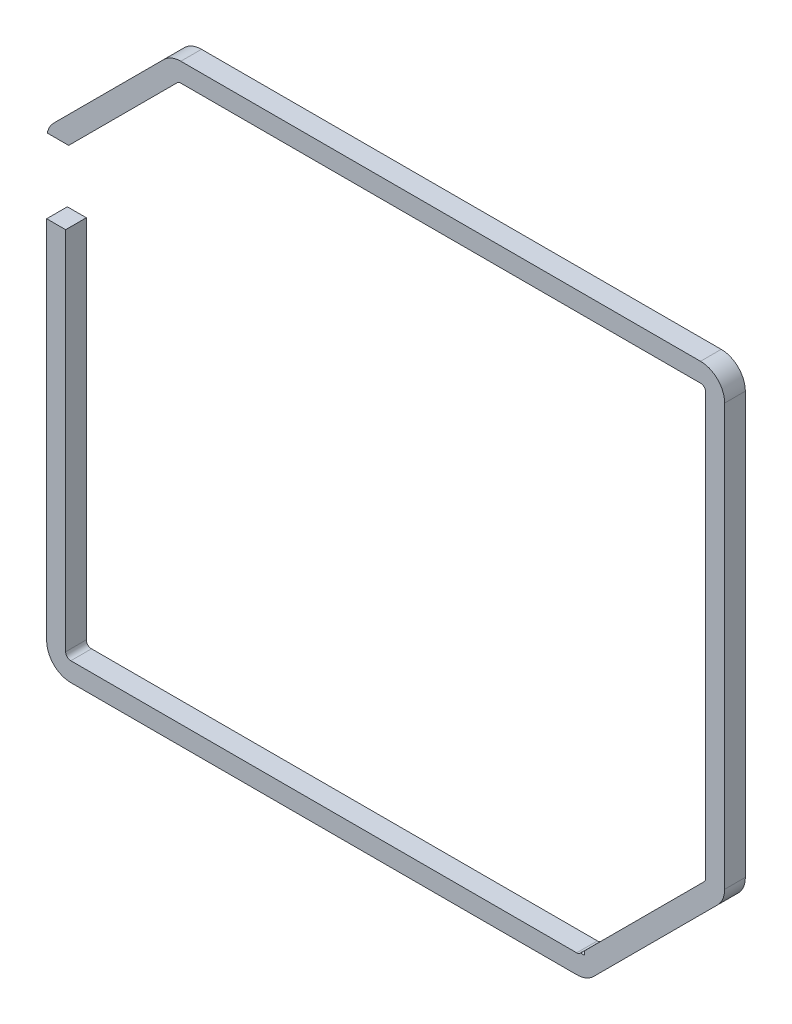
ISO-10303-21;
HEADER;
FILE_DESCRIPTION(('STEP AP214'),'2;1');
FILE_NAME('part.step','',(''),(''),'','','');
FILE_SCHEMA(('AUTOMOTIVE_DESIGN { 1 0 10303 214 1 1 1 1 }'));
ENDSEC;
DATA;
#1=APPLICATION_CONTEXT('core data for automotive mechanical design processes');
#2=APPLICATION_PROTOCOL_DEFINITION('international standard','automotive_design',2000,#1);
#3=PRODUCT_CONTEXT('',#1,'mechanical');
#4=PRODUCT('Part','Part','',(#3));
#5=PRODUCT_RELATED_PRODUCT_CATEGORY('part','',(#4));
#6=PRODUCT_DEFINITION_FORMATION('','',#4);
#7=PRODUCT_DEFINITION_CONTEXT('part definition',#1,'design');
#8=PRODUCT_DEFINITION('design','',#6,#7);
#9=PRODUCT_DEFINITION_SHAPE('','',#8);
#10=(LENGTH_UNIT() NAMED_UNIT(*) SI_UNIT(.MILLI.,.METRE.));
#11=(NAMED_UNIT(*) PLANE_ANGLE_UNIT() SI_UNIT($,.RADIAN.));
#12=(NAMED_UNIT(*) SI_UNIT($,.STERADIAN.) SOLID_ANGLE_UNIT());
#13=UNCERTAINTY_MEASURE_WITH_UNIT(LENGTH_MEASURE(1.E-05),#10,'distance_accuracy_value','');
#14=(GEOMETRIC_REPRESENTATION_CONTEXT(3) GLOBAL_UNCERTAINTY_ASSIGNED_CONTEXT((#13)) GLOBAL_UNIT_ASSIGNED_CONTEXT((#10,
#11,#12)) REPRESENTATION_CONTEXT('',''));
#15=CARTESIAN_POINT('',(0.,0.,0.));
#16=DIRECTION('',(0.,0.,1.));
#17=DIRECTION('',(1.,0.,0.));
#18=AXIS2_PLACEMENT_3D('',#15,#16,#17);
#19=CARTESIAN_POINT('',(0.,36.5,0.));
#20=DIRECTION('',(0.,-1.,0.));
#21=DIRECTION('',(0.,0.,-1.));
#22=AXIS2_PLACEMENT_3D('',#19,#20,#21);
#23=PLANE('',#22);
#24=DIRECTION('',(0.,0.,1.));
#25=VECTOR('',#24,1.);
#26=CARTESIAN_POINT('',(-15.2499221867958,36.5,0.));
#27=LINE('',#26,#25);
#28=CARTESIAN_POINT('',(-15.2499221867958,36.5,0.));
#29=VERTEX_POINT('',#28);
#30=CARTESIAN_POINT('',(-15.2499221867958,36.5,3.));
#31=VERTEX_POINT('',#30);
#32=EDGE_CURVE('E330',#29,#31,#27,.T.);
#33=ORIENTED_EDGE('',*,*,#32,.F.);
#34=DIRECTION('',(1.,0.,0.));
#35=VECTOR('',#34,1.);
#36=CARTESIAN_POINT('',(0.,36.5,0.));
#37=LINE('',#36,#35);
#38=CARTESIAN_POINT('',(-18.,36.5,0.));
#39=VERTEX_POINT('',#38);
#40=EDGE_CURVE('E352',#39,#29,#37,.T.);
#41=ORIENTED_EDGE('',*,*,#40,.F.);
#42=DIRECTION('',(0.,0.,1.));
#43=VECTOR('',#42,1.);
#44=CARTESIAN_POINT('',(-18.,36.5,0.));
#45=LINE('',#44,#43);
#46=CARTESIAN_POINT('',(-18.,36.5,3.));
#47=VERTEX_POINT('',#46);
#48=EDGE_CURVE('E361',#39,#47,#45,.T.);
#49=ORIENTED_EDGE('',*,*,#48,.T.);
#50=DIRECTION('',(1.,0.,0.));
#51=VECTOR('',#50,1.);
#52=CARTESIAN_POINT('',(0.,36.5,3.));
#53=LINE('',#52,#51);
#54=EDGE_CURVE('E353',#47,#31,#53,.T.);
#55=ORIENTED_EDGE('',*,*,#54,.T.);
#56=EDGE_LOOP('',(#33,#41,#49,#55));
#57=FACE_BOUND('',#56,.T.);
#58=ADVANCED_FACE('F34',(#57),#23,.F.);
#59=CARTESIAN_POINT('',(0.,0.,3.));
#60=DIRECTION('',(0.,0.,1.));
#61=DIRECTION('',(1.,0.,0.));
#62=AXIS2_PLACEMENT_3D('',#59,#60,#61);
#63=PLANE('',#62);
#64=DIRECTION('',(0.707106781186548,0.707106781186548,0.));
#65=VECTOR('',#64,1.);
#66=CARTESIAN_POINT('',(38.2054563517369,-38.2054563517369,3.));
#67=LINE('',#66,#65);
#68=CARTESIAN_POINT('',(59.380582617584,-17.0303300858899,3.));
#69=VERTEX_POINT('',#68);
#70=CARTESIAN_POINT('',(59.4109127034739,-17.,3.));
#71=VERTEX_POINT('',#70);
#72=EDGE_CURVE('E49',#69,#71,#67,.T.);
#73=ORIENTED_EDGE('',*,*,#72,.F.);
#74=CARTESIAN_POINT('',(58.8502525316941,-16.5,3.));
#75=DIRECTION('',(0.,0.,1.));
#76=DIRECTION('',(1.,0.,0.));
#77=AXIS2_PLACEMENT_3D('',#74,#75,#76);
#78=CIRCLE('',#77,0.750000000000003);
#79=CARTESIAN_POINT('',(58.8502525316941,-17.25,3.));
#80=VERTEX_POINT('',#79);
#81=EDGE_CURVE('E297',#80,#69,#78,.T.);
#82=ORIENTED_EDGE('',*,*,#81,.F.);
#83=DIRECTION('',(1.,0.,0.));
#84=VECTOR('',#83,1.);
#85=CARTESIAN_POINT('',(0.,-17.25,3.));
#86=LINE('',#85,#84);
#87=CARTESIAN_POINT('',(-14.5,-17.25,3.));
#88=VERTEX_POINT('',#87);
#89=EDGE_CURVE('E294',#88,#80,#86,.T.);
#90=ORIENTED_EDGE('',*,*,#89,.F.);
#91=CARTESIAN_POINT('',(-14.5,-16.5,3.));
#92=DIRECTION('',(0.,0.,1.));
#93=DIRECTION('',(1.,0.,0.));
#94=AXIS2_PLACEMENT_3D('',#91,#92,#93);
#95=CIRCLE('',#94,0.750000000000003);
#96=CARTESIAN_POINT('',(-15.25,-16.5,3.));
#97=VERTEX_POINT('',#96);
#98=EDGE_CURVE('E291',#97,#88,#95,.T.);
#99=ORIENTED_EDGE('',*,*,#98,.F.);
#100=DIRECTION('',(0.,-1.,0.));
#101=VECTOR('',#100,1.);
#102=CARTESIAN_POINT('',(-15.25,0.,3.));
#103=LINE('',#102,#101);
#104=CARTESIAN_POINT('',(-15.25,36.489656323568,3.));
#105=VERTEX_POINT('',#104);
#106=EDGE_CURVE('E288',#105,#97,#103,.T.);
#107=ORIENTED_EDGE('',*,*,#106,.F.);
#108=DIRECTION('',(0.0075225673419551,0.999971705089992,0.));
#109=VECTOR('',#108,1.);
#110=CARTESIAN_POINT('',(-15.5236251475961,0.116780819866848,3.));
#111=LINE('',#110,#109);
#112=EDGE_CURVE('E285',#105,#31,#111,.T.);
#113=ORIENTED_EDGE('',*,*,#112,.T.);
#114=ORIENTED_EDGE('',*,*,#54,.F.);
#115=DIRECTION('',(0.,-1.,0.));
#116=VECTOR('',#115,1.);
#117=CARTESIAN_POINT('',(-18.,0.,3.));
#118=LINE('',#117,#116);
#119=CARTESIAN_POINT('',(-18.,-16.5,3.));
#120=VERTEX_POINT('',#119);
#121=EDGE_CURVE('E379',#47,#120,#118,.T.);
#122=ORIENTED_EDGE('',*,*,#121,.T.);
#123=CARTESIAN_POINT('',(-14.5,-16.5,3.));
#124=DIRECTION('',(0.,0.,1.));
#125=DIRECTION('',(1.,0.,0.));
#126=AXIS2_PLACEMENT_3D('',#123,#124,#125);
#127=CIRCLE('',#126,3.5);
#128=CARTESIAN_POINT('',(-14.5,-20.,3.));
#129=VERTEX_POINT('',#128);
#130=EDGE_CURVE('E429',#120,#129,#127,.T.);
#131=ORIENTED_EDGE('',*,*,#130,.T.);
#132=DIRECTION('',(1.,0.,0.));
#133=VECTOR('',#132,1.);
#134=CARTESIAN_POINT('',(0.,-20.,3.));
#135=LINE('',#134,#133);
#136=CARTESIAN_POINT('',(58.8502525316941,-20.,3.));
#137=VERTEX_POINT('',#136);
#138=EDGE_CURVE('E381',#129,#137,#135,.T.);
#139=ORIENTED_EDGE('',*,*,#138,.T.);
#140=CARTESIAN_POINT('',(58.8502525316941,-16.5,3.));
#141=DIRECTION('',(0.,0.,1.));
#142=DIRECTION('',(1.,0.,0.));
#143=AXIS2_PLACEMENT_3D('',#140,#141,#142);
#144=CIRCLE('',#143,3.5);
#145=CARTESIAN_POINT('',(61.325126265847,-18.9748737341529,3.));
#146=VERTEX_POINT('',#145);
#147=EDGE_CURVE('E431',#137,#146,#144,.T.);
#148=ORIENTED_EDGE('',*,*,#147,.T.);
#149=DIRECTION('',(0.707106781186549,0.707106781186546,0.));
#150=VECTOR('',#149,1.);
#151=CARTESIAN_POINT('',(40.1499999999999,-40.15,3.));
#152=LINE('',#151,#150);
#153=CARTESIAN_POINT('',(79.2748737341529,-1.02512626584707,3.));
#154=VERTEX_POINT('',#153);
#155=EDGE_CURVE('E366',#146,#154,#152,.T.);
#156=ORIENTED_EDGE('',*,*,#155,.T.);
#157=CARTESIAN_POINT('',(76.8,1.44974746830586,3.));
#158=DIRECTION('',(0.,0.,1.));
#159=DIRECTION('',(1.,0.,0.));
#160=AXIS2_PLACEMENT_3D('',#157,#158,#159);
#161=CIRCLE('',#160,3.5);
#162=CARTESIAN_POINT('',(80.3,1.44974746830586,3.));
#163=VERTEX_POINT('',#162);
#164=EDGE_CURVE('E433',#154,#163,#161,.T.);
#165=ORIENTED_EDGE('',*,*,#164,.T.);
#166=DIRECTION('',(0.,1.,0.));
#167=VECTOR('',#166,1.);
#168=CARTESIAN_POINT('',(80.3,0.,3.));
#169=LINE('',#168,#167);
#170=CARTESIAN_POINT('',(80.3,62.5,3.));
#171=VERTEX_POINT('',#170);
#172=EDGE_CURVE('E369',#163,#171,#169,.T.);
#173=ORIENTED_EDGE('',*,*,#172,.T.);
#174=CARTESIAN_POINT('',(76.8,62.5,3.));
#175=DIRECTION('',(0.,0.,1.));
#176=DIRECTION('',(1.,0.,0.));
#177=AXIS2_PLACEMENT_3D('',#174,#175,#176);
#178=CIRCLE('',#177,3.5);
#179=CARTESIAN_POINT('',(76.8,66.,3.));
#180=VERTEX_POINT('',#179);
#181=EDGE_CURVE('E424',#171,#180,#178,.T.);
#182=ORIENTED_EDGE('',*,*,#181,.T.);
#183=DIRECTION('',(1.,0.,0.));
#184=VECTOR('',#183,1.);
#185=CARTESIAN_POINT('',(0.,66.,3.));
#186=LINE('',#185,#184);
#187=CARTESIAN_POINT('',(1.44974746830583,66.,3.));
#188=VERTEX_POINT('',#187);
#189=EDGE_CURVE('E373',#188,#180,#186,.T.);
#190=ORIENTED_EDGE('',*,*,#189,.F.);
#191=CARTESIAN_POINT('',(1.44974746830583,62.5,3.));
#192=DIRECTION('',(0.,0.,1.));
#193=DIRECTION('',(1.,0.,0.));
#194=AXIS2_PLACEMENT_3D('',#191,#192,#193);
#195=CIRCLE('',#194,3.5);
#196=CARTESIAN_POINT('',(-1.02512626584708,64.9748737341529,3.));
#197=VERTEX_POINT('',#196);
#198=EDGE_CURVE('E422',#188,#197,#195,.T.);
#199=ORIENTED_EDGE('',*,*,#198,.T.);
#200=DIRECTION('',(-0.707106781186549,-0.707106781186546,0.));
#201=VECTOR('',#200,1.);
#202=CARTESIAN_POINT('',(-33.,33.0000000000001,3.));
#203=LINE('',#202,#201);
#204=CARTESIAN_POINT('',(-16.9748737341529,49.0251262658471,3.));
#205=VERTEX_POINT('',#204);
#206=EDGE_CURVE('E376',#197,#205,#203,.T.);
#207=ORIENTED_EDGE('',*,*,#206,.T.);
#208=CARTESIAN_POINT('',(-14.5,46.5502525316942,3.));
#209=DIRECTION('',(0.,0.,1.));
#210=DIRECTION('',(1.,0.,0.));
#211=AXIS2_PLACEMENT_3D('',#208,#209,#210);
#212=CIRCLE('',#211,3.5);
#213=CARTESIAN_POINT('',(-17.9187539738579,47.3,3.));
#214=VERTEX_POINT('',#213);
#215=EDGE_CURVE('E426',#205,#214,#212,.T.);
#216=ORIENTED_EDGE('',*,*,#215,.T.);
#217=DIRECTION('',(1.,0.,0.));
#218=VECTOR('',#217,1.);
#219=CARTESIAN_POINT('',(0.,47.3,3.));
#220=LINE('',#219,#218);
#221=CARTESIAN_POINT('',(-14.810912703474,47.3,3.));
#222=VERTEX_POINT('',#221);
#223=EDGE_CURVE('E348',#214,#222,#220,.T.);
#224=ORIENTED_EDGE('',*,*,#223,.T.);
#225=DIRECTION('',(-0.707106781186547,-0.707106781186548,0.));
#226=VECTOR('',#225,1.);
#227=CARTESIAN_POINT('',(-31.055456351737,31.055456351737,3.));
#228=LINE('',#227,#226);
#229=CARTESIAN_POINT('',(0.919417382415921,63.0303300858899,3.));
#230=VERTEX_POINT('',#229);
#231=EDGE_CURVE('E283',#230,#222,#228,.T.);
#232=ORIENTED_EDGE('',*,*,#231,.F.);
#233=CARTESIAN_POINT('',(1.44974746830583,62.5,3.));
#234=DIRECTION('',(0.,0.,1.));
#235=DIRECTION('',(1.,0.,0.));
#236=AXIS2_PLACEMENT_3D('',#233,#234,#235);
#237=CIRCLE('',#236,0.75);
#238=CARTESIAN_POINT('',(1.44974746830583,63.25,3.));
#239=VERTEX_POINT('',#238);
#240=EDGE_CURVE('E281',#239,#230,#237,.T.);
#241=ORIENTED_EDGE('',*,*,#240,.F.);
#242=DIRECTION('',(1.,0.,0.));
#243=VECTOR('',#242,1.);
#244=CARTESIAN_POINT('',(0.,63.25,3.));
#245=LINE('',#244,#243);
#246=CARTESIAN_POINT('',(76.8,63.25,3.));
#247=VERTEX_POINT('',#246);
#248=EDGE_CURVE('E231',#239,#247,#245,.T.);
#249=ORIENTED_EDGE('',*,*,#248,.T.);
#250=CARTESIAN_POINT('',(76.8,62.5,3.));
#251=DIRECTION('',(0.,0.,1.));
#252=DIRECTION('',(1.,0.,0.));
#253=AXIS2_PLACEMENT_3D('',#250,#251,#252);
#254=CIRCLE('',#253,0.750000000000001);
#255=CARTESIAN_POINT('',(77.55,62.5,3.));
#256=VERTEX_POINT('',#255);
#257=EDGE_CURVE('E251',#256,#247,#254,.T.);
#258=ORIENTED_EDGE('',*,*,#257,.F.);
#259=DIRECTION('',(0.,1.,0.));
#260=VECTOR('',#259,1.);
#261=CARTESIAN_POINT('',(77.55,0.,3.));
#262=LINE('',#261,#260);
#263=CARTESIAN_POINT('',(77.55,1.44974746830586,3.));
#264=VERTEX_POINT('',#263);
#265=EDGE_CURVE('E254',#264,#256,#262,.T.);
#266=ORIENTED_EDGE('',*,*,#265,.F.);
#267=CARTESIAN_POINT('',(76.8,1.44974746830586,3.));
#268=DIRECTION('',(0.,0.,1.));
#269=DIRECTION('',(1.,0.,0.));
#270=AXIS2_PLACEMENT_3D('',#267,#268,#269);
#271=CIRCLE('',#270,0.749999999999983);
#272=CARTESIAN_POINT('',(77.3303300858899,0.919417382415959,3.));
#273=VERTEX_POINT('',#272);
#274=EDGE_CURVE('E302',#273,#264,#271,.T.);
#275=ORIENTED_EDGE('',*,*,#274,.F.);
#276=CARTESIAN_POINT('',(60.,-16.4109127034739,3.));
#277=VERTEX_POINT('',#276);
#278=EDGE_CURVE('E301',#277,#273,#67,.T.);
#279=ORIENTED_EDGE('',*,*,#278,.F.);
#280=DIRECTION('',(0.,1.,0.));
#281=VECTOR('',#280,1.);
#282=CARTESIAN_POINT('',(60.,0.,3.));
#283=LINE('',#282,#281);
#284=CARTESIAN_POINT('',(60.,-17.,3.));
#285=VERTEX_POINT('',#284);
#286=EDGE_CURVE('E339',#285,#277,#283,.T.);
#287=ORIENTED_EDGE('',*,*,#286,.F.);
#288=DIRECTION('',(1.,0.,0.));
#289=VECTOR('',#288,1.);
#290=CARTESIAN_POINT('',(0.,-17.,3.));
#291=LINE('',#290,#289);
#292=EDGE_CURVE('E309',#71,#285,#291,.T.);
#293=ORIENTED_EDGE('',*,*,#292,.F.);
#294=EDGE_LOOP('',(#73,#82,#90,#99,#107,#113,#114,#122,#131,#139,#148,#156,#165,#173,#182,#190,
#199,#207,#216,#224,#232,#241,#249,#258,#266,#275,#279,#287,#293));
#295=FACE_BOUND('',#294,.T.);
#296=ADVANCED_FACE('F456',(#295),#63,.T.);
#297=CARTESIAN_POINT('',(0.,0.,0.));
#298=DIRECTION('',(0.,0.,1.));
#299=DIRECTION('',(1.,0.,0.));
#300=AXIS2_PLACEMENT_3D('',#297,#298,#299);
#301=PLANE('',#300);
#302=CARTESIAN_POINT('',(58.8502525316941,-16.5,0.));
#303=DIRECTION('',(0.,0.,1.));
#304=DIRECTION('',(1.,0.,0.));
#305=AXIS2_PLACEMENT_3D('',#302,#303,#304);
#306=CIRCLE('',#305,0.750000000000003);
#307=CARTESIAN_POINT('',(58.8502525316941,-17.25,0.));
#308=VERTEX_POINT('',#307);
#309=CARTESIAN_POINT('',(59.380582617584,-17.0303300858899,0.));
#310=VERTEX_POINT('',#309);
#311=EDGE_CURVE('E269',#308,#310,#306,.T.);
#312=ORIENTED_EDGE('',*,*,#311,.T.);
#313=DIRECTION('',(0.707106781186548,0.707106781186548,0.));
#314=VECTOR('',#313,1.);
#315=CARTESIAN_POINT('',(38.2054563517369,-38.2054563517369,0.));
#316=LINE('',#315,#314);
#317=CARTESIAN_POINT('',(59.4109127034739,-17.,0.));
#318=VERTEX_POINT('',#317);
#319=EDGE_CURVE('E271',#310,#318,#316,.T.);
#320=ORIENTED_EDGE('',*,*,#319,.T.);
#321=DIRECTION('',(1.,0.,0.));
#322=VECTOR('',#321,1.);
#323=CARTESIAN_POINT('',(0.,-17.,0.));
#324=LINE('',#323,#322);
#325=CARTESIAN_POINT('',(60.,-17.,0.));
#326=VERTEX_POINT('',#325);
#327=EDGE_CURVE('E336',#318,#326,#324,.T.);
#328=ORIENTED_EDGE('',*,*,#327,.T.);
#329=DIRECTION('',(0.,1.,0.));
#330=VECTOR('',#329,1.);
#331=CARTESIAN_POINT('',(60.,0.,0.));
#332=LINE('',#331,#330);
#333=CARTESIAN_POINT('',(60.,-16.4109127034739,0.));
#334=VERTEX_POINT('',#333);
#335=EDGE_CURVE('E338',#326,#334,#332,.T.);
#336=ORIENTED_EDGE('',*,*,#335,.T.);
#337=CARTESIAN_POINT('',(77.3303300858899,0.919417382415959,0.));
#338=VERTEX_POINT('',#337);
#339=EDGE_CURVE('E57',#334,#338,#316,.T.);
#340=ORIENTED_EDGE('',*,*,#339,.T.);
#341=CARTESIAN_POINT('',(76.8,1.44974746830586,0.));
#342=DIRECTION('',(0.,0.,1.));
#343=DIRECTION('',(1.,0.,0.));
#344=AXIS2_PLACEMENT_3D('',#341,#342,#343);
#345=CIRCLE('',#344,0.749999999999983);
#346=CARTESIAN_POINT('',(77.55,1.44974746830586,0.));
#347=VERTEX_POINT('',#346);
#348=EDGE_CURVE('E274',#338,#347,#345,.T.);
#349=ORIENTED_EDGE('',*,*,#348,.T.);
#350=DIRECTION('',(0.,1.,0.));
#351=VECTOR('',#350,1.);
#352=CARTESIAN_POINT('',(77.55,0.,0.));
#353=LINE('',#352,#351);
#354=CARTESIAN_POINT('',(77.55,62.5,0.));
#355=VERTEX_POINT('',#354);
#356=EDGE_CURVE('E277',#347,#355,#353,.T.);
#357=ORIENTED_EDGE('',*,*,#356,.T.);
#358=CARTESIAN_POINT('',(76.8,62.5,0.));
#359=DIRECTION('',(0.,0.,1.));
#360=DIRECTION('',(1.,0.,0.));
#361=AXIS2_PLACEMENT_3D('',#358,#359,#360);
#362=CIRCLE('',#361,0.750000000000001);
#363=CARTESIAN_POINT('',(76.8,63.25,0.));
#364=VERTEX_POINT('',#363);
#365=EDGE_CURVE('E236',#355,#364,#362,.T.);
#366=ORIENTED_EDGE('',*,*,#365,.T.);
#367=DIRECTION('',(1.,0.,0.));
#368=VECTOR('',#367,1.);
#369=CARTESIAN_POINT('',(0.,63.25,0.));
#370=LINE('',#369,#368);
#371=CARTESIAN_POINT('',(1.44974746830583,63.25,0.));
#372=VERTEX_POINT('',#371);
#373=EDGE_CURVE('E228',#372,#364,#370,.T.);
#374=ORIENTED_EDGE('',*,*,#373,.F.);
#375=CARTESIAN_POINT('',(1.44974746830583,62.5,0.));
#376=DIRECTION('',(0.,0.,1.));
#377=DIRECTION('',(1.,0.,0.));
#378=AXIS2_PLACEMENT_3D('',#375,#376,#377);
#379=CIRCLE('',#378,0.75);
#380=CARTESIAN_POINT('',(0.919417382415921,63.0303300858899,0.));
#381=VERTEX_POINT('',#380);
#382=EDGE_CURVE('E239',#372,#381,#379,.T.);
#383=ORIENTED_EDGE('',*,*,#382,.T.);
#384=DIRECTION('',(-0.707106781186547,-0.707106781186548,0.));
#385=VECTOR('',#384,1.);
#386=CARTESIAN_POINT('',(-31.055456351737,31.055456351737,0.));
#387=LINE('',#386,#385);
#388=CARTESIAN_POINT('',(-14.810912703474,47.3,0.));
#389=VERTEX_POINT('',#388);
#390=EDGE_CURVE('E244',#381,#389,#387,.T.);
#391=ORIENTED_EDGE('',*,*,#390,.T.);
#392=DIRECTION('',(1.,0.,0.));
#393=VECTOR('',#392,1.);
#394=CARTESIAN_POINT('',(0.,47.3,0.));
#395=LINE('',#394,#393);
#396=CARTESIAN_POINT('',(-17.9187539738579,47.3,0.));
#397=VERTEX_POINT('',#396);
#398=EDGE_CURVE('E349',#397,#389,#395,.T.);
#399=ORIENTED_EDGE('',*,*,#398,.F.);
#400=CARTESIAN_POINT('',(-14.5,46.5502525316942,0.));
#401=DIRECTION('',(0.,0.,1.));
#402=DIRECTION('',(1.,0.,0.));
#403=AXIS2_PLACEMENT_3D('',#400,#401,#402);
#404=CIRCLE('',#403,3.5);
#405=CARTESIAN_POINT('',(-16.9748737341529,49.0251262658471,0.));
#406=VERTEX_POINT('',#405);
#407=EDGE_CURVE('E408',#397,#406,#404,.F.);
#408=ORIENTED_EDGE('',*,*,#407,.T.);
#409=DIRECTION('',(-0.707106781186549,-0.707106781186546,0.));
#410=VECTOR('',#409,1.);
#411=CARTESIAN_POINT('',(-33.,33.0000000000001,0.));
#412=LINE('',#411,#410);
#413=CARTESIAN_POINT('',(-1.02512626584708,64.9748737341529,0.));
#414=VERTEX_POINT('',#413);
#415=EDGE_CURVE('E393',#414,#406,#412,.T.);
#416=ORIENTED_EDGE('',*,*,#415,.F.);
#417=CARTESIAN_POINT('',(1.44974746830583,62.5,0.));
#418=DIRECTION('',(0.,0.,1.));
#419=DIRECTION('',(1.,0.,0.));
#420=AXIS2_PLACEMENT_3D('',#417,#418,#419);
#421=CIRCLE('',#420,3.5);
#422=CARTESIAN_POINT('',(1.44974746830583,66.,0.));
#423=VERTEX_POINT('',#422);
#424=EDGE_CURVE('E404',#414,#423,#421,.F.);
#425=ORIENTED_EDGE('',*,*,#424,.T.);
#426=DIRECTION('',(1.,0.,0.));
#427=VECTOR('',#426,1.);
#428=CARTESIAN_POINT('',(0.,66.,0.));
#429=LINE('',#428,#427);
#430=CARTESIAN_POINT('',(76.8,66.,0.));
#431=VERTEX_POINT('',#430);
#432=EDGE_CURVE('E390',#423,#431,#429,.T.);
#433=ORIENTED_EDGE('',*,*,#432,.T.);
#434=CARTESIAN_POINT('',(76.8,62.5,0.));
#435=DIRECTION('',(0.,0.,1.));
#436=DIRECTION('',(1.,0.,0.));
#437=AXIS2_PLACEMENT_3D('',#434,#435,#436);
#438=CIRCLE('',#437,3.5);
#439=CARTESIAN_POINT('',(80.3,62.5,0.));
#440=VERTEX_POINT('',#439);
#441=EDGE_CURVE('E406',#431,#440,#438,.F.);
#442=ORIENTED_EDGE('',*,*,#441,.T.);
#443=DIRECTION('',(0.,1.,0.));
#444=VECTOR('',#443,1.);
#445=CARTESIAN_POINT('',(80.3,0.,0.));
#446=LINE('',#445,#444);
#447=CARTESIAN_POINT('',(80.3,1.44974746830586,0.));
#448=VERTEX_POINT('',#447);
#449=EDGE_CURVE('E387',#448,#440,#446,.T.);
#450=ORIENTED_EDGE('',*,*,#449,.F.);
#451=CARTESIAN_POINT('',(76.8,1.44974746830586,0.));
#452=DIRECTION('',(0.,0.,1.));
#453=DIRECTION('',(1.,0.,0.));
#454=AXIS2_PLACEMENT_3D('',#451,#452,#453);
#455=CIRCLE('',#454,3.5);
#456=CARTESIAN_POINT('',(79.2748737341529,-1.02512626584707,0.));
#457=VERTEX_POINT('',#456);
#458=EDGE_CURVE('E415',#448,#457,#455,.F.);
#459=ORIENTED_EDGE('',*,*,#458,.T.);
#460=DIRECTION('',(0.707106781186549,0.707106781186546,0.));
#461=VECTOR('',#460,1.);
#462=CARTESIAN_POINT('',(40.1499999999999,-40.15,0.));
#463=LINE('',#462,#461);
#464=CARTESIAN_POINT('',(61.325126265847,-18.9748737341529,0.));
#465=VERTEX_POINT('',#464);
#466=EDGE_CURVE('E363',#465,#457,#463,.T.);
#467=ORIENTED_EDGE('',*,*,#466,.F.);
#468=CARTESIAN_POINT('',(58.8502525316941,-16.5,0.));
#469=DIRECTION('',(0.,0.,1.));
#470=DIRECTION('',(1.,0.,0.));
#471=AXIS2_PLACEMENT_3D('',#468,#469,#470);
#472=CIRCLE('',#471,3.5);
#473=CARTESIAN_POINT('',(58.8502525316941,-20.,0.));
#474=VERTEX_POINT('',#473);
#475=EDGE_CURVE('E413',#465,#474,#472,.F.);
#476=ORIENTED_EDGE('',*,*,#475,.T.);
#477=DIRECTION('',(1.,0.,0.));
#478=VECTOR('',#477,1.);
#479=CARTESIAN_POINT('',(0.,-20.,0.));
#480=LINE('',#479,#478);
#481=CARTESIAN_POINT('',(-14.5,-20.,0.));
#482=VERTEX_POINT('',#481);
#483=EDGE_CURVE('E370',#482,#474,#480,.T.);
#484=ORIENTED_EDGE('',*,*,#483,.F.);
#485=CARTESIAN_POINT('',(-14.5,-16.5,0.));
#486=DIRECTION('',(0.,0.,1.));
#487=DIRECTION('',(1.,0.,0.));
#488=AXIS2_PLACEMENT_3D('',#485,#486,#487);
#489=CIRCLE('',#488,3.5);
#490=CARTESIAN_POINT('',(-18.,-16.5,0.));
#491=VERTEX_POINT('',#490);
#492=EDGE_CURVE('E410',#482,#491,#489,.F.);
#493=ORIENTED_EDGE('',*,*,#492,.T.);
#494=DIRECTION('',(0.,-1.,0.));
#495=VECTOR('',#494,1.);
#496=CARTESIAN_POINT('',(-18.,0.,0.));
#497=LINE('',#496,#495);
#498=EDGE_CURVE('E396',#39,#491,#497,.T.);
#499=ORIENTED_EDGE('',*,*,#498,.F.);
#500=ORIENTED_EDGE('',*,*,#40,.T.);
#501=DIRECTION('',(0.0075225673419551,0.999971705089992,0.));
#502=VECTOR('',#501,1.);
#503=CARTESIAN_POINT('',(-15.5236251475961,0.116780819866848,0.));
#504=LINE('',#503,#502);
#505=CARTESIAN_POINT('',(-15.25,36.489656323568,0.));
#506=VERTEX_POINT('',#505);
#507=EDGE_CURVE('E258',#506,#29,#504,.T.);
#508=ORIENTED_EDGE('',*,*,#507,.F.);
#509=DIRECTION('',(0.,-1.,0.));
#510=VECTOR('',#509,1.);
#511=CARTESIAN_POINT('',(-15.25,0.,0.));
#512=LINE('',#511,#510);
#513=CARTESIAN_POINT('',(-15.25,-16.5,0.));
#514=VERTEX_POINT('',#513);
#515=EDGE_CURVE('E260',#506,#514,#512,.T.);
#516=ORIENTED_EDGE('',*,*,#515,.T.);
#517=CARTESIAN_POINT('',(-14.5,-16.5,0.));
#518=DIRECTION('',(0.,0.,1.));
#519=DIRECTION('',(1.,0.,0.));
#520=AXIS2_PLACEMENT_3D('',#517,#518,#519);
#521=CIRCLE('',#520,0.750000000000003);
#522=CARTESIAN_POINT('',(-14.5,-17.25,0.));
#523=VERTEX_POINT('',#522);
#524=EDGE_CURVE('E263',#514,#523,#521,.T.);
#525=ORIENTED_EDGE('',*,*,#524,.T.);
#526=DIRECTION('',(1.,0.,0.));
#527=VECTOR('',#526,1.);
#528=CARTESIAN_POINT('',(0.,-17.25,0.));
#529=LINE('',#528,#527);
#530=EDGE_CURVE('E266',#523,#308,#529,.T.);
#531=ORIENTED_EDGE('',*,*,#530,.T.);
#532=EDGE_LOOP('',(#312,#320,#328,#336,#340,#349,#357,#366,#374,#383,#391,#399,#408,#416,#425,
#433,#442,#450,#459,#467,#476,#484,#493,#499,#500,#508,#516,#525,#531));
#533=FACE_BOUND('',#532,.T.);
#534=ADVANCED_FACE('F248',(#533),#301,.F.);
#535=CARTESIAN_POINT('',(-14.5,46.5502525316942,3.));
#536=DIRECTION('',(0.,0.,-1.));
#537=DIRECTION('',(-1.,0.,0.));
#538=AXIS2_PLACEMENT_3D('',#535,#536,#537);
#539=CYLINDRICAL_SURFACE('',#538,3.5);
#540=ORIENTED_EDGE('',*,*,#407,.F.);
#541=DIRECTION('',(0.,0.,1.));
#542=VECTOR('',#541,1.);
#543=CARTESIAN_POINT('',(-17.9187539738579,47.3,0.));
#544=LINE('',#543,#542);
#545=EDGE_CURVE('E356',#397,#214,#544,.T.);
#546=ORIENTED_EDGE('',*,*,#545,.T.);
#547=ORIENTED_EDGE('',*,*,#215,.F.);
#548=DIRECTION('',(0.,0.,-1.));
#549=VECTOR('',#548,1.);
#550=CARTESIAN_POINT('',(-16.9748737341529,49.0251262658471,3.));
#551=LINE('',#550,#549);
#552=EDGE_CURVE('E446',#406,#205,#551,.F.);
#553=ORIENTED_EDGE('',*,*,#552,.F.);
#554=EDGE_LOOP('',(#540,#546,#547,#553));
#555=FACE_BOUND('',#554,.T.);
#556=ADVANCED_FACE('F467',(#555),#539,.T.);
#557=CARTESIAN_POINT('',(40.1499999999999,-40.15,3.));
#558=DIRECTION('',(-0.707106781186546,0.707106781186548,0.));
#559=DIRECTION('',(-0.707106781186549,-0.707106781186546,0.));
#560=AXIS2_PLACEMENT_3D('',#557,#558,#559);
#561=PLANE('',#560);
#562=ORIENTED_EDGE('',*,*,#466,.T.);
#563=DIRECTION('',(0.,0.,-1.));
#564=VECTOR('',#563,1.);
#565=CARTESIAN_POINT('',(79.2748737341529,-1.02512626584707,3.));
#566=LINE('',#565,#564);
#567=EDGE_CURVE('E420',#457,#154,#566,.F.);
#568=ORIENTED_EDGE('',*,*,#567,.T.);
#569=ORIENTED_EDGE('',*,*,#155,.F.);
#570=DIRECTION('',(0.,0.,-1.));
#571=VECTOR('',#570,1.);
#572=CARTESIAN_POINT('',(61.325126265847,-18.9748737341529,3.));
#573=LINE('',#572,#571);
#574=EDGE_CURVE('E417',#146,#465,#573,.T.);
#575=ORIENTED_EDGE('',*,*,#574,.T.);
#576=EDGE_LOOP('',(#562,#568,#569,#575));
#577=FACE_BOUND('',#576,.T.);
#578=ADVANCED_FACE('F573',(#577),#561,.F.);
#579=CARTESIAN_POINT('',(80.3,0.,3.));
#580=DIRECTION('',(-1.,0.,0.));
#581=DIRECTION('',(0.,0.,1.));
#582=AXIS2_PLACEMENT_3D('',#579,#580,#581);
#583=PLANE('',#582);
#584=ORIENTED_EDGE('',*,*,#172,.F.);
#585=DIRECTION('',(0.,0.,-1.));
#586=VECTOR('',#585,1.);
#587=CARTESIAN_POINT('',(80.3,1.44974746830586,3.));
#588=LINE('',#587,#586);
#589=EDGE_CURVE('E401',#163,#448,#588,.T.);
#590=ORIENTED_EDGE('',*,*,#589,.T.);
#591=ORIENTED_EDGE('',*,*,#449,.T.);
#592=DIRECTION('',(0.,0.,-1.));
#593=VECTOR('',#592,1.);
#594=CARTESIAN_POINT('',(80.3,62.5,3.));
#595=LINE('',#594,#593);
#596=EDGE_CURVE('E384',#440,#171,#595,.F.);
#597=ORIENTED_EDGE('',*,*,#596,.T.);
#598=EDGE_LOOP('',(#584,#590,#591,#597));
#599=FACE_BOUND('',#598,.T.);
#600=ADVANCED_FACE('F570',(#599),#583,.F.);
#601=CARTESIAN_POINT('',(0.,66.,3.));
#602=DIRECTION('',(0.,1.,0.));
#603=DIRECTION('',(0.,0.,1.));
#604=AXIS2_PLACEMENT_3D('',#601,#602,#603);
#605=PLANE('',#604);
#606=ORIENTED_EDGE('',*,*,#189,.T.);
#607=DIRECTION('',(0.,0.,-1.));
#608=VECTOR('',#607,1.);
#609=CARTESIAN_POINT('',(76.8,66.,0.));
#610=LINE('',#609,#608);
#611=EDGE_CURVE('E11',#180,#431,#610,.T.);
#612=ORIENTED_EDGE('',*,*,#611,.T.);
#613=ORIENTED_EDGE('',*,*,#432,.F.);
#614=DIRECTION('',(0.,0.,-1.));
#615=VECTOR('',#614,1.);
#616=CARTESIAN_POINT('',(1.44974746830583,66.,3.));
#617=LINE('',#616,#615);
#618=EDGE_CURVE('E42',#423,#188,#617,.F.);
#619=ORIENTED_EDGE('',*,*,#618,.T.);
#620=EDGE_LOOP('',(#606,#612,#613,#619));
#621=FACE_BOUND('',#620,.T.);
#622=ADVANCED_FACE('F451',(#621),#605,.T.);
#623=CARTESIAN_POINT('',(-33.,33.0000000000001,3.));
#624=DIRECTION('',(0.707106781186546,-0.707106781186548,0.));
#625=DIRECTION('',(0.707106781186549,0.707106781186546,0.));
#626=AXIS2_PLACEMENT_3D('',#623,#624,#625);
#627=PLANE('',#626);
#628=ORIENTED_EDGE('',*,*,#415,.T.);
#629=ORIENTED_EDGE('',*,*,#552,.T.);
#630=ORIENTED_EDGE('',*,*,#206,.F.);
#631=DIRECTION('',(0.,0.,-1.));
#632=VECTOR('',#631,1.);
#633=CARTESIAN_POINT('',(-1.02512626584708,64.9748737341529,0.));
#634=LINE('',#633,#632);
#635=EDGE_CURVE('E443',#197,#414,#634,.T.);
#636=ORIENTED_EDGE('',*,*,#635,.T.);
#637=EDGE_LOOP('',(#628,#629,#630,#636));
#638=FACE_BOUND('',#637,.T.);
#639=ADVANCED_FACE('F462',(#638),#627,.F.);
#640=CARTESIAN_POINT('',(-18.,0.,3.));
#641=DIRECTION('',(1.,0.,0.));
#642=DIRECTION('',(0.,1.,0.));
#643=AXIS2_PLACEMENT_3D('',#640,#641,#642);
#644=PLANE('',#643);
#645=ORIENTED_EDGE('',*,*,#121,.F.);
#646=ORIENTED_EDGE('',*,*,#48,.F.);
#647=ORIENTED_EDGE('',*,*,#498,.T.);
#648=DIRECTION('',(0.,0.,-1.));
#649=VECTOR('',#648,1.);
#650=CARTESIAN_POINT('',(-18.,-16.5,3.));
#651=LINE('',#650,#649);
#652=EDGE_CURVE('E440',#491,#120,#651,.F.);
#653=ORIENTED_EDGE('',*,*,#652,.T.);
#654=EDGE_LOOP('',(#645,#646,#647,#653));
#655=FACE_BOUND('',#654,.T.);
#656=ADVANCED_FACE('F526',(#655),#644,.F.);
#657=CARTESIAN_POINT('',(0.,-20.,3.));
#658=DIRECTION('',(0.,1.,0.));
#659=DIRECTION('',(0.,0.,1.));
#660=AXIS2_PLACEMENT_3D('',#657,#658,#659);
#661=PLANE('',#660);
#662=ORIENTED_EDGE('',*,*,#483,.T.);
#663=DIRECTION('',(0.,0.,-1.));
#664=VECTOR('',#663,1.);
#665=CARTESIAN_POINT('',(58.8502525316941,-20.,3.));
#666=LINE('',#665,#664);
#667=EDGE_CURVE('E438',#474,#137,#666,.F.);
#668=ORIENTED_EDGE('',*,*,#667,.T.);
#669=ORIENTED_EDGE('',*,*,#138,.F.);
#670=DIRECTION('',(0.,0.,-1.));
#671=VECTOR('',#670,1.);
#672=CARTESIAN_POINT('',(-14.5,-20.,3.));
#673=LINE('',#672,#671);
#674=EDGE_CURVE('E435',#129,#482,#673,.T.);
#675=ORIENTED_EDGE('',*,*,#674,.T.);
#676=EDGE_LOOP('',(#662,#668,#669,#675));
#677=FACE_BOUND('',#676,.T.);
#678=ADVANCED_FACE('F533',(#677),#661,.F.);
#679=CARTESIAN_POINT('',(76.8,1.44974746830586,3.));
#680=DIRECTION('',(0.,0.,-1.));
#681=DIRECTION('',(-1.,0.,0.));
#682=AXIS2_PLACEMENT_3D('',#679,#680,#681);
#683=CYLINDRICAL_SURFACE('',#682,3.5);
#684=ORIENTED_EDGE('',*,*,#164,.F.);
#685=ORIENTED_EDGE('',*,*,#567,.F.);
#686=ORIENTED_EDGE('',*,*,#458,.F.);
#687=ORIENTED_EDGE('',*,*,#589,.F.);
#688=EDGE_LOOP('',(#684,#685,#686,#687));
#689=FACE_BOUND('',#688,.T.);
#690=ADVANCED_FACE('F545',(#689),#683,.T.);
#691=CARTESIAN_POINT('',(58.8502525316941,-16.5,3.));
#692=DIRECTION('',(0.,0.,-1.));
#693=DIRECTION('',(-1.,0.,0.));
#694=AXIS2_PLACEMENT_3D('',#691,#692,#693);
#695=CYLINDRICAL_SURFACE('',#694,3.5);
#696=ORIENTED_EDGE('',*,*,#147,.F.);
#697=ORIENTED_EDGE('',*,*,#667,.F.);
#698=ORIENTED_EDGE('',*,*,#475,.F.);
#699=ORIENTED_EDGE('',*,*,#574,.F.);
#700=EDGE_LOOP('',(#696,#697,#698,#699));
#701=FACE_BOUND('',#700,.T.);
#702=ADVANCED_FACE('F538',(#701),#695,.T.);
#703=CARTESIAN_POINT('',(-14.5,-16.5,3.));
#704=DIRECTION('',(0.,0.,-1.));
#705=DIRECTION('',(-1.,0.,0.));
#706=AXIS2_PLACEMENT_3D('',#703,#704,#705);
#707=CYLINDRICAL_SURFACE('',#706,3.5);
#708=ORIENTED_EDGE('',*,*,#130,.F.);
#709=ORIENTED_EDGE('',*,*,#652,.F.);
#710=ORIENTED_EDGE('',*,*,#492,.F.);
#711=ORIENTED_EDGE('',*,*,#674,.F.);
#712=EDGE_LOOP('',(#708,#709,#710,#711));
#713=FACE_BOUND('',#712,.T.);
#714=ADVANCED_FACE('F535',(#713),#707,.T.);
#715=CARTESIAN_POINT('',(76.8,62.5,3.));
#716=DIRECTION('',(0.,0.,1.));
#717=DIRECTION('',(1.,0.,0.));
#718=AXIS2_PLACEMENT_3D('',#715,#716,#717);
#719=CYLINDRICAL_SURFACE('',#718,3.5);
#720=ORIENTED_EDGE('',*,*,#181,.F.);
#721=ORIENTED_EDGE('',*,*,#596,.F.);
#722=ORIENTED_EDGE('',*,*,#441,.F.);
#723=ORIENTED_EDGE('',*,*,#611,.F.);
#724=EDGE_LOOP('',(#720,#721,#722,#723));
#725=FACE_BOUND('',#724,.T.);
#726=ADVANCED_FACE('F537',(#725),#719,.T.);
#727=CARTESIAN_POINT('',(1.44974746830583,62.5,3.));
#728=DIRECTION('',(0.,0.,1.));
#729=DIRECTION('',(1.,0.,0.));
#730=AXIS2_PLACEMENT_3D('',#727,#728,#729);
#731=CYLINDRICAL_SURFACE('',#730,3.5);
#732=ORIENTED_EDGE('',*,*,#198,.F.);
#733=ORIENTED_EDGE('',*,*,#618,.F.);
#734=ORIENTED_EDGE('',*,*,#424,.F.);
#735=ORIENTED_EDGE('',*,*,#635,.F.);
#736=EDGE_LOOP('',(#732,#733,#734,#735));
#737=FACE_BOUND('',#736,.T.);
#738=ADVANCED_FACE('F36',(#737),#731,.T.);
#739=CARTESIAN_POINT('',(0.,47.3,0.));
#740=DIRECTION('',(0.,-1.,0.));
#741=DIRECTION('',(1.,0.,0.));
#742=AXIS2_PLACEMENT_3D('',#739,#740,#741);
#743=PLANE('',#742);
#744=DIRECTION('',(0.,0.,1.));
#745=VECTOR('',#744,1.);
#746=CARTESIAN_POINT('',(-14.810912703474,47.3,0.));
#747=LINE('',#746,#745);
#748=EDGE_CURVE('E332',#389,#222,#747,.T.);
#749=ORIENTED_EDGE('',*,*,#748,.T.);
#750=ORIENTED_EDGE('',*,*,#223,.F.);
#751=ORIENTED_EDGE('',*,*,#545,.F.);
#752=ORIENTED_EDGE('',*,*,#398,.T.);
#753=EDGE_LOOP('',(#749,#750,#751,#752));
#754=FACE_BOUND('',#753,.T.);
#755=ADVANCED_FACE('F471',(#754),#743,.T.);
#756=CARTESIAN_POINT('',(0.,-17.,0.));
#757=DIRECTION('',(0.,-1.,0.));
#758=DIRECTION('',(0.,0.,-1.));
#759=AXIS2_PLACEMENT_3D('',#756,#757,#758);
#760=PLANE('',#759);
#761=ORIENTED_EDGE('',*,*,#327,.F.);
#762=DIRECTION('',(0.,0.,1.));
#763=VECTOR('',#762,1.);
#764=CARTESIAN_POINT('',(59.4109127034739,-17.,0.));
#765=LINE('',#764,#763);
#766=EDGE_CURVE('E318',#318,#71,#765,.T.);
#767=ORIENTED_EDGE('',*,*,#766,.T.);
#768=ORIENTED_EDGE('',*,*,#292,.T.);
#769=DIRECTION('',(0.,0.,1.));
#770=VECTOR('',#769,1.);
#771=CARTESIAN_POINT('',(60.,-17.,0.));
#772=LINE('',#771,#770);
#773=EDGE_CURVE('E342',#326,#285,#772,.T.);
#774=ORIENTED_EDGE('',*,*,#773,.F.);
#775=EDGE_LOOP('',(#761,#767,#768,#774));
#776=FACE_BOUND('',#775,.T.);
#777=ADVANCED_FACE('F495',(#776),#760,.F.);
#778=CARTESIAN_POINT('',(60.,0.,0.));
#779=DIRECTION('',(1.,0.,0.));
#780=DIRECTION('',(0.,0.,-1.));
#781=AXIS2_PLACEMENT_3D('',#778,#779,#780);
#782=PLANE('',#781);
#783=ORIENTED_EDGE('',*,*,#286,.T.);
#784=DIRECTION('',(0.,0.,1.));
#785=VECTOR('',#784,1.);
#786=CARTESIAN_POINT('',(60.,-16.4109127034739,0.));
#787=LINE('',#786,#785);
#788=EDGE_CURVE('E316',#334,#277,#787,.T.);
#789=ORIENTED_EDGE('',*,*,#788,.F.);
#790=ORIENTED_EDGE('',*,*,#335,.F.);
#791=ORIENTED_EDGE('',*,*,#773,.T.);
#792=EDGE_LOOP('',(#783,#789,#790,#791));
#793=FACE_BOUND('',#792,.T.);
#794=ADVANCED_FACE('F490',(#793),#782,.F.);
#795=CARTESIAN_POINT('',(-31.055456351737,31.055456351737,0.));
#796=DIRECTION('',(-0.707106781186548,0.707106781186547,0.));
#797=DIRECTION('',(-0.707106781186547,-0.707106781186548,0.));
#798=AXIS2_PLACEMENT_3D('',#795,#796,#797);
#799=PLANE('',#798);
#800=ORIENTED_EDGE('',*,*,#231,.T.);
#801=ORIENTED_EDGE('',*,*,#748,.F.);
#802=ORIENTED_EDGE('',*,*,#390,.F.);
#803=DIRECTION('',(0.,0.,1.));
#804=VECTOR('',#803,1.);
#805=CARTESIAN_POINT('',(0.919417382415921,63.0303300858899,0.));
#806=LINE('',#805,#804);
#807=EDGE_CURVE('E235',#381,#230,#806,.T.);
#808=ORIENTED_EDGE('',*,*,#807,.T.);
#809=EDGE_LOOP('',(#800,#801,#802,#808));
#810=FACE_BOUND('',#809,.T.);
#811=ADVANCED_FACE('F473',(#810),#799,.F.);
#812=CARTESIAN_POINT('',(1.44974746830583,62.5,0.));
#813=DIRECTION('',(0.,0.,1.));
#814=DIRECTION('',(1.,0.,0.));
#815=AXIS2_PLACEMENT_3D('',#812,#813,#814);
#816=CYLINDRICAL_SURFACE('',#815,0.75);
#817=ORIENTED_EDGE('',*,*,#240,.T.);
#818=ORIENTED_EDGE('',*,*,#807,.F.);
#819=ORIENTED_EDGE('',*,*,#382,.F.);
#820=DIRECTION('',(0.,0.,1.));
#821=VECTOR('',#820,1.);
#822=CARTESIAN_POINT('',(1.44974746830583,63.25,0.));
#823=LINE('',#822,#821);
#824=EDGE_CURVE('E224',#372,#239,#823,.T.);
#825=ORIENTED_EDGE('',*,*,#824,.T.);
#826=EDGE_LOOP('',(#817,#818,#819,#825));
#827=FACE_BOUND('',#826,.T.);
#828=ADVANCED_FACE('F240',(#827),#816,.F.);
#829=CARTESIAN_POINT('',(38.2054563517369,-38.2054563517369,0.));
#830=DIRECTION('',(0.707106781186547,-0.707106781186547,0.));
#831=DIRECTION('',(0.707106781186548,0.707106781186548,0.));
#832=AXIS2_PLACEMENT_3D('',#829,#830,#831);
#833=PLANE('',#832);
#834=ORIENTED_EDGE('',*,*,#278,.T.);
#835=DIRECTION('',(0.,0.,1.));
#836=VECTOR('',#835,1.);
#837=CARTESIAN_POINT('',(77.3303300858899,0.919417382415959,0.));
#838=LINE('',#837,#836);
#839=EDGE_CURVE('E314',#338,#273,#838,.T.);
#840=ORIENTED_EDGE('',*,*,#839,.F.);
#841=ORIENTED_EDGE('',*,*,#339,.F.);
#842=ORIENTED_EDGE('',*,*,#788,.T.);
#843=EDGE_LOOP('',(#834,#840,#841,#842));
#844=FACE_BOUND('',#843,.T.);
#845=ADVANCED_FACE('F684',(#844),#833,.F.);
#846=CARTESIAN_POINT('',(76.8,1.44974746830586,0.));
#847=DIRECTION('',(0.,0.,1.));
#848=DIRECTION('',(1.,0.,0.));
#849=AXIS2_PLACEMENT_3D('',#846,#847,#848);
#850=CYLINDRICAL_SURFACE('',#849,0.749999999999983);
#851=ORIENTED_EDGE('',*,*,#274,.T.);
#852=DIRECTION('',(0.,0.,1.));
#853=VECTOR('',#852,1.);
#854=CARTESIAN_POINT('',(77.55,1.44974746830586,0.));
#855=LINE('',#854,#853);
#856=EDGE_CURVE('E312',#347,#264,#855,.T.);
#857=ORIENTED_EDGE('',*,*,#856,.F.);
#858=ORIENTED_EDGE('',*,*,#348,.F.);
#859=ORIENTED_EDGE('',*,*,#839,.T.);
#860=EDGE_LOOP('',(#851,#857,#858,#859));
#861=FACE_BOUND('',#860,.T.);
#862=ADVANCED_FACE('F484',(#861),#850,.F.);
#863=CARTESIAN_POINT('',(77.55,0.,0.));
#864=DIRECTION('',(1.,0.,0.));
#865=DIRECTION('',(0.,0.,-1.));
#866=AXIS2_PLACEMENT_3D('',#863,#864,#865);
#867=PLANE('',#866);
#868=ORIENTED_EDGE('',*,*,#265,.T.);
#869=DIRECTION('',(0.,0.,1.));
#870=VECTOR('',#869,1.);
#871=CARTESIAN_POINT('',(77.55,62.5,0.));
#872=LINE('',#871,#870);
#873=EDGE_CURVE('E310',#355,#256,#872,.T.);
#874=ORIENTED_EDGE('',*,*,#873,.F.);
#875=ORIENTED_EDGE('',*,*,#356,.F.);
#876=ORIENTED_EDGE('',*,*,#856,.T.);
#877=EDGE_LOOP('',(#868,#874,#875,#876));
#878=FACE_BOUND('',#877,.T.);
#879=ADVANCED_FACE('F481',(#878),#867,.F.);
#880=CARTESIAN_POINT('',(76.8,62.5,0.));
#881=DIRECTION('',(0.,0.,1.));
#882=DIRECTION('',(1.,0.,0.));
#883=AXIS2_PLACEMENT_3D('',#880,#881,#882);
#884=CYLINDRICAL_SURFACE('',#883,0.750000000000001);
#885=ORIENTED_EDGE('',*,*,#257,.T.);
#886=DIRECTION('',(0.,0.,1.));
#887=VECTOR('',#886,1.);
#888=CARTESIAN_POINT('',(76.8,63.25,0.));
#889=LINE('',#888,#887);
#890=EDGE_CURVE('E307',#364,#247,#889,.T.);
#891=ORIENTED_EDGE('',*,*,#890,.F.);
#892=ORIENTED_EDGE('',*,*,#365,.F.);
#893=ORIENTED_EDGE('',*,*,#873,.T.);
#894=EDGE_LOOP('',(#885,#891,#892,#893));
#895=FACE_BOUND('',#894,.T.);
#896=ADVANCED_FACE('F478',(#895),#884,.F.);
#897=CARTESIAN_POINT('',(0.,63.25,0.));
#898=DIRECTION('',(0.,-1.,0.));
#899=DIRECTION('',(0.,0.,-1.));
#900=AXIS2_PLACEMENT_3D('',#897,#898,#899);
#901=PLANE('',#900);
#902=ORIENTED_EDGE('',*,*,#248,.F.);
#903=ORIENTED_EDGE('',*,*,#824,.F.);
#904=ORIENTED_EDGE('',*,*,#373,.T.);
#905=ORIENTED_EDGE('',*,*,#890,.T.);
#906=EDGE_LOOP('',(#902,#903,#904,#905));
#907=FACE_BOUND('',#906,.T.);
#908=ADVANCED_FACE('F226',(#907),#901,.T.);
#909=ORIENTED_EDGE('',*,*,#72,.T.);
#910=ORIENTED_EDGE('',*,*,#766,.F.);
#911=ORIENTED_EDGE('',*,*,#319,.F.);
#912=DIRECTION('',(0.,0.,1.));
#913=VECTOR('',#912,1.);
#914=CARTESIAN_POINT('',(59.380582617584,-17.0303300858899,0.));
#915=LINE('',#914,#913);
#916=EDGE_CURVE('E320',#310,#69,#915,.T.);
#917=ORIENTED_EDGE('',*,*,#916,.T.);
#918=EDGE_LOOP('',(#909,#910,#911,#917));
#919=FACE_BOUND('',#918,.T.);
#920=ADVANCED_FACE('F694',(#919),#833,.F.);
#921=CARTESIAN_POINT('',(58.8502525316941,-16.5,0.));
#922=DIRECTION('',(0.,0.,1.));
#923=DIRECTION('',(1.,0.,0.));
#924=AXIS2_PLACEMENT_3D('',#921,#922,#923);
#925=CYLINDRICAL_SURFACE('',#924,0.750000000000003);
#926=ORIENTED_EDGE('',*,*,#81,.T.);
#927=ORIENTED_EDGE('',*,*,#916,.F.);
#928=ORIENTED_EDGE('',*,*,#311,.F.);
#929=DIRECTION('',(0.,0.,1.));
#930=VECTOR('',#929,1.);
#931=CARTESIAN_POINT('',(58.8502525316941,-17.25,0.));
#932=LINE('',#931,#930);
#933=EDGE_CURVE('E322',#308,#80,#932,.T.);
#934=ORIENTED_EDGE('',*,*,#933,.T.);
#935=EDGE_LOOP('',(#926,#927,#928,#934));
#936=FACE_BOUND('',#935,.T.);
#937=ADVANCED_FACE('F500',(#936),#925,.F.);
#938=CARTESIAN_POINT('',(0.,-17.25,0.));
#939=DIRECTION('',(0.,-1.,0.));
#940=DIRECTION('',(0.,0.,-1.));
#941=AXIS2_PLACEMENT_3D('',#938,#939,#940);
#942=PLANE('',#941);
#943=ORIENTED_EDGE('',*,*,#89,.T.);
#944=ORIENTED_EDGE('',*,*,#933,.F.);
#945=ORIENTED_EDGE('',*,*,#530,.F.);
#946=DIRECTION('',(0.,0.,1.));
#947=VECTOR('',#946,1.);
#948=CARTESIAN_POINT('',(-14.5,-17.25,0.));
#949=LINE('',#948,#947);
#950=EDGE_CURVE('E324',#523,#88,#949,.T.);
#951=ORIENTED_EDGE('',*,*,#950,.T.);
#952=EDGE_LOOP('',(#943,#944,#945,#951));
#953=FACE_BOUND('',#952,.T.);
#954=ADVANCED_FACE('F505',(#953),#942,.F.);
#955=CARTESIAN_POINT('',(-14.5,-16.5,0.));
#956=DIRECTION('',(0.,0.,1.));
#957=DIRECTION('',(1.,0.,0.));
#958=AXIS2_PLACEMENT_3D('',#955,#956,#957);
#959=CYLINDRICAL_SURFACE('',#958,0.750000000000003);
#960=ORIENTED_EDGE('',*,*,#98,.T.);
#961=ORIENTED_EDGE('',*,*,#950,.F.);
#962=ORIENTED_EDGE('',*,*,#524,.F.);
#963=DIRECTION('',(0.,0.,1.));
#964=VECTOR('',#963,1.);
#965=CARTESIAN_POINT('',(-15.25,-16.5,0.));
#966=LINE('',#965,#964);
#967=EDGE_CURVE('E326',#514,#97,#966,.T.);
#968=ORIENTED_EDGE('',*,*,#967,.T.);
#969=EDGE_LOOP('',(#960,#961,#962,#968));
#970=FACE_BOUND('',#969,.T.);
#971=ADVANCED_FACE('F508',(#970),#959,.F.);
#972=CARTESIAN_POINT('',(-15.25,0.,0.));
#973=DIRECTION('',(-1.,0.,0.));
#974=DIRECTION('',(0.,0.,1.));
#975=AXIS2_PLACEMENT_3D('',#972,#973,#974);
#976=PLANE('',#975);
#977=ORIENTED_EDGE('',*,*,#106,.T.);
#978=ORIENTED_EDGE('',*,*,#967,.F.);
#979=ORIENTED_EDGE('',*,*,#515,.F.);
#980=DIRECTION('',(0.,0.,1.));
#981=VECTOR('',#980,1.);
#982=CARTESIAN_POINT('',(-15.25,36.489656323568,0.));
#983=LINE('',#982,#981);
#984=EDGE_CURVE('E328',#506,#105,#983,.T.);
#985=ORIENTED_EDGE('',*,*,#984,.T.);
#986=EDGE_LOOP('',(#977,#978,#979,#985));
#987=FACE_BOUND('',#986,.T.);
#988=ADVANCED_FACE('F513',(#987),#976,.F.);
#989=CARTESIAN_POINT('',(-15.5236251475961,0.116780819866848,0.));
#990=DIRECTION('',(0.999971705089992,-0.0075225673419551,0.));
#991=DIRECTION('',(0.0075225673419551,0.999971705089992,0.));
#992=AXIS2_PLACEMENT_3D('',#989,#990,#991);
#993=PLANE('',#992);
#994=ORIENTED_EDGE('',*,*,#112,.F.);
#995=ORIENTED_EDGE('',*,*,#984,.F.);
#996=ORIENTED_EDGE('',*,*,#507,.T.);
#997=ORIENTED_EDGE('',*,*,#32,.T.);
#998=EDGE_LOOP('',(#994,#995,#996,#997));
#999=FACE_BOUND('',#998,.T.);
#1000=ADVANCED_FACE('F517',(#999),#993,.T.);
#1001=CLOSED_SHELL('',(#58,#296,#534,#556,#578,#600,#622,#639,#656,#678,#690,#702,#714,#726,
#738,#755,#777,#794,#811,#828,#845,#862,#879,#896,#908,#920,#937,#954,#971,#988,#1000));
#1002=MANIFOLD_SOLID_BREP('B2',#1001);
#1003=ADVANCED_BREP_SHAPE_REPRESENTATION('',(#18,#1002),#14);
#1004=SHAPE_DEFINITION_REPRESENTATION(#9,#1003);
ENDSEC;
END-ISO-10303-21;
